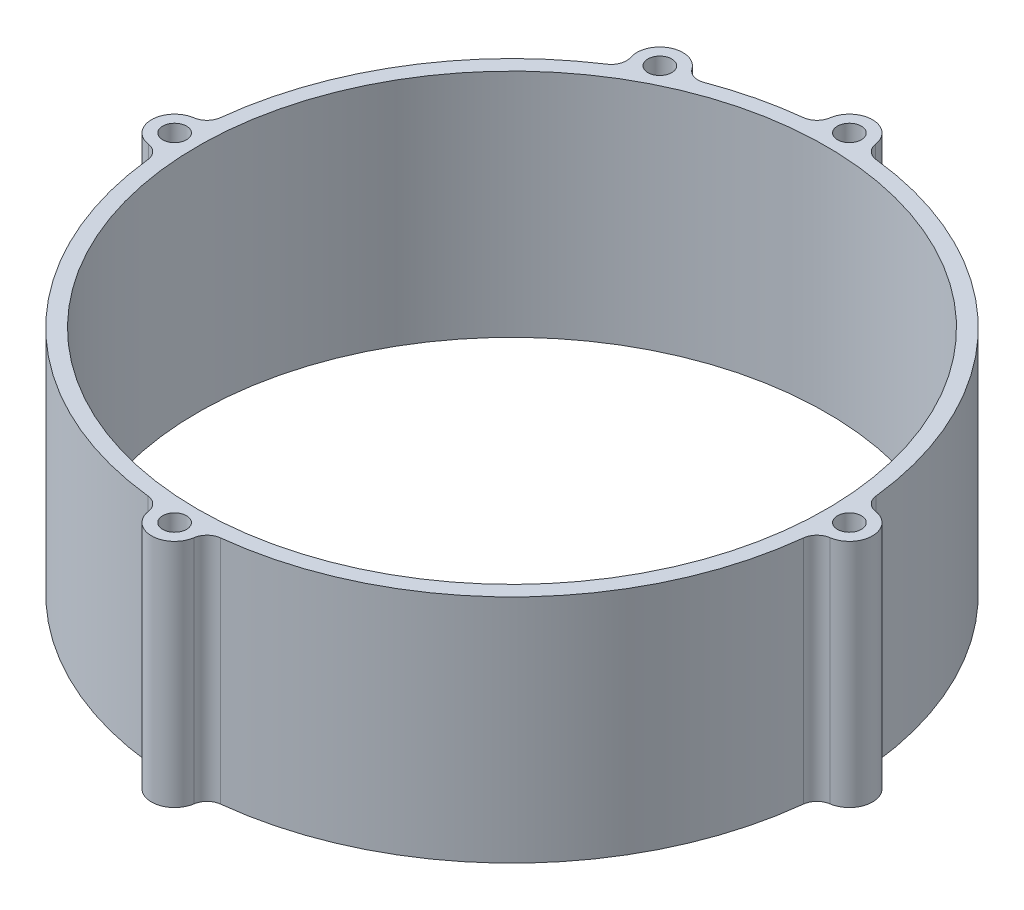
ISO-10303-21;
HEADER;
FILE_DESCRIPTION(('STEP AP214'),'2;1');
FILE_NAME('part.step','',(''),(''),'','','');
FILE_SCHEMA(('AUTOMOTIVE_DESIGN { 1 0 10303 214 1 1 1 1 }'));
ENDSEC;
DATA;
#1=APPLICATION_CONTEXT('core data for automotive mechanical design processes');
#2=APPLICATION_PROTOCOL_DEFINITION('international standard','automotive_design',2000,#1);
#3=PRODUCT_CONTEXT('',#1,'mechanical');
#4=PRODUCT('Part','Part','',(#3));
#5=PRODUCT_RELATED_PRODUCT_CATEGORY('part','',(#4));
#6=PRODUCT_DEFINITION_FORMATION('','',#4);
#7=PRODUCT_DEFINITION_CONTEXT('part definition',#1,'design');
#8=PRODUCT_DEFINITION('design','',#6,#7);
#9=PRODUCT_DEFINITION_SHAPE('','',#8);
#10=(LENGTH_UNIT() NAMED_UNIT(*) SI_UNIT(.MILLI.,.METRE.));
#11=(NAMED_UNIT(*) PLANE_ANGLE_UNIT() SI_UNIT($,.RADIAN.));
#12=(NAMED_UNIT(*) SI_UNIT($,.STERADIAN.) SOLID_ANGLE_UNIT());
#13=UNCERTAINTY_MEASURE_WITH_UNIT(LENGTH_MEASURE(1.E-05),#10,'distance_accuracy_value','');
#14=(GEOMETRIC_REPRESENTATION_CONTEXT(3) GLOBAL_UNCERTAINTY_ASSIGNED_CONTEXT((#13)) GLOBAL_UNIT_ASSIGNED_CONTEXT((#10,
#11,#12)) REPRESENTATION_CONTEXT('',''));
#15=CARTESIAN_POINT('',(0.,0.,0.));
#16=DIRECTION('',(0.,0.,1.));
#17=DIRECTION('',(1.,0.,0.));
#18=AXIS2_PLACEMENT_3D('',#15,#16,#17);
#19=CARTESIAN_POINT('',(-7.90996375997345,30.,-21.0103539550362));
#20=DIRECTION('',(0.,1.,0.));
#21=DIRECTION('',(0.,0.,1.));
#22=AXIS2_PLACEMENT_3D('',#19,#20,#21);
#23=PLANE('',#22);
#24=CARTESIAN_POINT('',(-43.9,30.,0.));
#25=DIRECTION('',(0.,1.,0.));
#26=DIRECTION('',(0.,0.,1.));
#27=AXIS2_PLACEMENT_3D('',#24,#25,#26);
#28=CIRCLE('',#27,1.55);
#29=CARTESIAN_POINT('',(-43.9,30.,1.55));
#30=VERTEX_POINT('',#29);
#31=EDGE_CURVE('E409',#30,#30,#28,.T.);
#32=ORIENTED_EDGE('',*,*,#31,.F.);
#33=EDGE_LOOP('',(#32));
#34=FACE_BOUND('',#33,.T.);
#35=CARTESIAN_POINT('',(43.9,30.,0.));
#36=DIRECTION('',(0.,1.,0.));
#37=DIRECTION('',(0.,0.,1.));
#38=AXIS2_PLACEMENT_3D('',#35,#36,#37);
#39=CIRCLE('',#38,1.55);
#40=CARTESIAN_POINT('',(43.9,30.,1.55000000000002));
#41=VERTEX_POINT('',#40);
#42=EDGE_CURVE('E421',#41,#41,#39,.T.);
#43=ORIENTED_EDGE('',*,*,#42,.F.);
#44=EDGE_LOOP('',(#43));
#45=FACE_BOUND('',#44,.T.);
#46=CARTESIAN_POINT('',(0.,30.,-43.9));
#47=DIRECTION('',(0.,1.,0.));
#48=DIRECTION('',(0.,0.,1.));
#49=AXIS2_PLACEMENT_3D('',#46,#47,#48);
#50=CIRCLE('',#49,1.55);
#51=CARTESIAN_POINT('',(0.,30.,-42.35));
#52=VERTEX_POINT('',#51);
#53=EDGE_CURVE('E212',#52,#52,#50,.T.);
#54=ORIENTED_EDGE('',*,*,#53,.F.);
#55=EDGE_LOOP('',(#54));
#56=FACE_BOUND('',#55,.T.);
#57=CARTESIAN_POINT('',(-15.8199275199469,30.,-42.0207079100725));
#58=DIRECTION('',(0.,-1.,0.));
#59=DIRECTION('',(0.,0.,1.));
#60=AXIS2_PLACEMENT_3D('',#57,#58,#59);
#61=CIRCLE('',#60,2.);
#62=CARTESIAN_POINT('',(-15.1152536883234,30.,-40.1489614552808));
#63=VERTEX_POINT('',#62);
#64=CARTESIAN_POINT('',(-17.4519565119681,30.,-40.8646450358299));
#65=VERTEX_POINT('',#64);
#66=EDGE_CURVE('E247',#63,#65,#61,.T.);
#67=ORIENTED_EDGE('',*,*,#66,.T.);
#68=CARTESIAN_POINT('',(-19.9,30.,-39.1305507244659));
#69=DIRECTION('',(0.,1.,0.));
#70=DIRECTION('',(0.,0.,1.));
#71=AXIS2_PLACEMENT_3D('',#68,#69,#70);
#72=CIRCLE('',#71,2.99999999999999);
#73=CARTESIAN_POINT('',(-22.743315409618,30.,-38.1737030451413));
#74=VERTEX_POINT('',#73);
#75=EDGE_CURVE('E135',#65,#74,#72,.T.);
#76=ORIENTED_EDGE('',*,*,#75,.T.);
#77=CARTESIAN_POINT('',(-24.63885901603,30.,-37.5358045922583));
#78=DIRECTION('',(0.,-1.,0.));
#79=DIRECTION('',(0.,0.,-1.));
#80=AXIS2_PLACEMENT_3D('',#77,#78,#79);
#81=CIRCLE('',#80,2.);
#82=CARTESIAN_POINT('',(-23.5413597280108,30.,-35.8638311137613));
#83=VERTEX_POINT('',#82);
#84=EDGE_CURVE('E298',#74,#83,#81,.T.);
#85=ORIENTED_EDGE('',*,*,#84,.T.);
#86=CARTESIAN_POINT('',(0.,30.,0.));
#87=DIRECTION('',(0.,1.,0.));
#88=DIRECTION('',(0.,0.,1.));
#89=AXIS2_PLACEMENT_3D('',#86,#87,#88);
#90=CIRCLE('',#89,42.9);
#91=CARTESIAN_POINT('',(-42.638827361233,30.,-4.72656336665109));
#92=VERTEX_POINT('',#91);
#93=EDGE_CURVE('E317',#83,#92,#90,.T.);
#94=ORIENTED_EDGE('',*,*,#93,.T.);
#95=CARTESIAN_POINT('',(-44.6266514806378,30.,-4.94691597115697));
#96=DIRECTION('',(0.,-1.,0.));
#97=DIRECTION('',(0.,0.,1.));
#98=AXIS2_PLACEMENT_3D('',#95,#96,#97);
#99=CIRCLE('',#98,2.);
#100=CARTESIAN_POINT('',(-44.3359908883827,30.,-2.96814958269422));
#101=VERTEX_POINT('',#100);
#102=EDGE_CURVE('E314',#92,#101,#99,.T.);
#103=ORIENTED_EDGE('',*,*,#102,.T.);
#104=CARTESIAN_POINT('',(-43.9,30.,0.));
#105=DIRECTION('',(0.,1.,0.));
#106=DIRECTION('',(0.,0.,1.));
#107=AXIS2_PLACEMENT_3D('',#104,#105,#106);
#108=CIRCLE('',#107,3.00000000000005);
#109=CARTESIAN_POINT('',(-44.3359908883827,30.,2.96814958269417));
#110=VERTEX_POINT('',#109);
#111=EDGE_CURVE('E316',#101,#110,#108,.T.);
#112=ORIENTED_EDGE('',*,*,#111,.T.);
#113=CARTESIAN_POINT('',(-44.6266514806378,30.,4.94691597115686));
#114=DIRECTION('',(0.,-1.,0.));
#115=DIRECTION('',(0.,0.,-1.));
#116=AXIS2_PLACEMENT_3D('',#113,#114,#115);
#117=CIRCLE('',#116,2.);
#118=CARTESIAN_POINT('',(-42.638827361233,30.,4.72656336665099));
#119=VERTEX_POINT('',#118);
#120=EDGE_CURVE('E319',#110,#119,#117,.T.);
#121=ORIENTED_EDGE('',*,*,#120,.T.);
#122=CARTESIAN_POINT('',(0.,30.,0.));
#123=DIRECTION('',(0.,1.,0.));
#124=DIRECTION('',(0.,0.,1.));
#125=AXIS2_PLACEMENT_3D('',#122,#123,#124);
#126=CIRCLE('',#125,42.9);
#127=CARTESIAN_POINT('',(-4.72656336665098,30.,42.638827361233));
#128=VERTEX_POINT('',#127);
#129=EDGE_CURVE('E325',#119,#128,#126,.T.);
#130=ORIENTED_EDGE('',*,*,#129,.T.);
#131=CARTESIAN_POINT('',(-4.94691597115685,30.,44.6266514806378));
#132=DIRECTION('',(0.,-1.,0.));
#133=DIRECTION('',(0.,0.,1.));
#134=AXIS2_PLACEMENT_3D('',#131,#132,#133);
#135=CIRCLE('',#134,2.);
#136=CARTESIAN_POINT('',(-2.9681495826941,30.,44.3359908883827));
#137=VERTEX_POINT('',#136);
#138=EDGE_CURVE('E327',#128,#137,#135,.T.);
#139=ORIENTED_EDGE('',*,*,#138,.T.);
#140=CARTESIAN_POINT('',(0.,30.,43.9));
#141=DIRECTION('',(0.,1.,0.));
#142=DIRECTION('',(0.,0.,1.));
#143=AXIS2_PLACEMENT_3D('',#140,#141,#142);
#144=CIRCLE('',#143,3.);
#145=CARTESIAN_POINT('',(2.96814958269413,30.,44.3359908883827));
#146=VERTEX_POINT('',#145);
#147=EDGE_CURVE('E329',#137,#146,#144,.T.);
#148=ORIENTED_EDGE('',*,*,#147,.T.);
#149=CARTESIAN_POINT('',(4.94691597115688,30.,44.6266514806378));
#150=DIRECTION('',(0.,-1.,0.));
#151=DIRECTION('',(0.,0.,-1.));
#152=AXIS2_PLACEMENT_3D('',#149,#150,#151);
#153=CIRCLE('',#152,2.00000000000001);
#154=CARTESIAN_POINT('',(4.72656336665101,30.,42.638827361233));
#155=VERTEX_POINT('',#154);
#156=EDGE_CURVE('E331',#146,#155,#153,.T.);
#157=ORIENTED_EDGE('',*,*,#156,.T.);
#158=CARTESIAN_POINT('',(0.,30.,0.));
#159=DIRECTION('',(0.,1.,0.));
#160=DIRECTION('',(0.,0.,1.));
#161=AXIS2_PLACEMENT_3D('',#158,#159,#160);
#162=CIRCLE('',#161,42.9);
#163=CARTESIAN_POINT('',(42.638827361233,30.,4.72656336665101));
#164=VERTEX_POINT('',#163);
#165=EDGE_CURVE('E333',#155,#164,#162,.T.);
#166=ORIENTED_EDGE('',*,*,#165,.T.);
#167=CARTESIAN_POINT('',(44.6266514806378,30.,4.94691597115688));
#168=DIRECTION('',(0.,-1.,0.));
#169=DIRECTION('',(0.,0.,1.));
#170=AXIS2_PLACEMENT_3D('',#167,#168,#169);
#171=CIRCLE('',#170,2.);
#172=CARTESIAN_POINT('',(44.3359908883827,30.,2.96814958269413));
#173=VERTEX_POINT('',#172);
#174=EDGE_CURVE('E335',#164,#173,#171,.T.);
#175=ORIENTED_EDGE('',*,*,#174,.T.);
#176=CARTESIAN_POINT('',(43.9,30.,0.));
#177=DIRECTION('',(0.,1.,0.));
#178=DIRECTION('',(0.,0.,1.));
#179=AXIS2_PLACEMENT_3D('',#176,#177,#178);
#180=CIRCLE('',#179,3.);
#181=CARTESIAN_POINT('',(44.3359908883827,30.,-2.9681495826941));
#182=VERTEX_POINT('',#181);
#183=EDGE_CURVE('E337',#173,#182,#180,.T.);
#184=ORIENTED_EDGE('',*,*,#183,.T.);
#185=CARTESIAN_POINT('',(44.6266514806378,30.,-4.94691597115684));
#186=DIRECTION('',(0.,-1.,0.));
#187=DIRECTION('',(0.,0.,-1.));
#188=AXIS2_PLACEMENT_3D('',#185,#186,#187);
#189=CIRCLE('',#188,2.);
#190=CARTESIAN_POINT('',(42.638827361233,30.,-4.72656336665097));
#191=VERTEX_POINT('',#190);
#192=EDGE_CURVE('E339',#182,#191,#189,.T.);
#193=ORIENTED_EDGE('',*,*,#192,.T.);
#194=CARTESIAN_POINT('',(0.,30.,0.));
#195=DIRECTION('',(0.,1.,0.));
#196=DIRECTION('',(0.,0.,1.));
#197=AXIS2_PLACEMENT_3D('',#194,#195,#196);
#198=CIRCLE('',#197,42.9);
#199=CARTESIAN_POINT('',(4.72656336665099,30.,-42.638827361233));
#200=VERTEX_POINT('',#199);
#201=EDGE_CURVE('E341',#191,#200,#198,.T.);
#202=ORIENTED_EDGE('',*,*,#201,.T.);
#203=CARTESIAN_POINT('',(4.94691597115686,30.,-44.6266514806378));
#204=DIRECTION('',(0.,-1.,0.));
#205=DIRECTION('',(0.,0.,1.));
#206=AXIS2_PLACEMENT_3D('',#203,#204,#205);
#207=CIRCLE('',#206,2.);
#208=CARTESIAN_POINT('',(2.96814958269411,30.,-44.3359908883827));
#209=VERTEX_POINT('',#208);
#210=EDGE_CURVE('E190',#200,#209,#207,.T.);
#211=ORIENTED_EDGE('',*,*,#210,.T.);
#212=CARTESIAN_POINT('',(0.,30.,-43.9));
#213=DIRECTION('',(0.,1.,0.));
#214=DIRECTION('',(0.,0.,1.));
#215=AXIS2_PLACEMENT_3D('',#212,#213,#214);
#216=CIRCLE('',#215,3.);
#217=CARTESIAN_POINT('',(-2.96814958269412,30.,-44.3359908883827));
#218=VERTEX_POINT('',#217);
#219=EDGE_CURVE('E184',#209,#218,#216,.T.);
#220=ORIENTED_EDGE('',*,*,#219,.T.);
#221=CARTESIAN_POINT('',(-4.94691597115686,30.,-44.6266514806378));
#222=DIRECTION('',(0.,-1.,0.));
#223=DIRECTION('',(0.,0.,1.));
#224=AXIS2_PLACEMENT_3D('',#221,#222,#223);
#225=CIRCLE('',#224,2.);
#226=CARTESIAN_POINT('',(-4.72656336665099,30.,-42.638827361233));
#227=VERTEX_POINT('',#226);
#228=EDGE_CURVE('E188',#218,#227,#225,.T.);
#229=ORIENTED_EDGE('',*,*,#228,.T.);
#230=CARTESIAN_POINT('',(0.,30.,0.));
#231=DIRECTION('',(0.,1.,0.));
#232=DIRECTION('',(0.,0.,1.));
#233=AXIS2_PLACEMENT_3D('',#230,#231,#232);
#234=CIRCLE('',#233,42.9);
#235=EDGE_CURVE('E56',#227,#63,#234,.T.);
#236=ORIENTED_EDGE('',*,*,#235,.T.);
#237=EDGE_LOOP('',(#67,#76,#85,#94,#103,#112,#121,#130,#139,#148,#157,#166,#175,#184,#193,#202,
#211,#220,#229,#236));
#238=FACE_BOUND('',#237,.T.);
#239=CARTESIAN_POINT('',(-19.9,30.,-39.1305507244659));
#240=DIRECTION('',(0.,1.,0.));
#241=DIRECTION('',(0.,0.,1.));
#242=AXIS2_PLACEMENT_3D('',#239,#240,#241);
#243=CIRCLE('',#242,1.55);
#244=CARTESIAN_POINT('',(-19.9,30.,-37.5805507244659));
#245=VERTEX_POINT('',#244);
#246=EDGE_CURVE('E427',#245,#245,#243,.T.);
#247=ORIENTED_EDGE('',*,*,#246,.F.);
#248=EDGE_LOOP('',(#247));
#249=FACE_BOUND('',#248,.T.);
#250=CARTESIAN_POINT('',(0.,30.,43.9));
#251=DIRECTION('',(0.,1.,0.));
#252=DIRECTION('',(0.,0.,1.));
#253=AXIS2_PLACEMENT_3D('',#250,#251,#252);
#254=CIRCLE('',#253,1.55);
#255=CARTESIAN_POINT('',(0.,30.,45.45));
#256=VERTEX_POINT('',#255);
#257=EDGE_CURVE('E415',#256,#256,#254,.T.);
#258=ORIENTED_EDGE('',*,*,#257,.F.);
#259=EDGE_LOOP('',(#258));
#260=FACE_BOUND('',#259,.T.);
#261=CARTESIAN_POINT('',(0.,30.,0.));
#262=DIRECTION('',(0.,1.,0.));
#263=DIRECTION('',(0.,0.,1.));
#264=AXIS2_PLACEMENT_3D('',#261,#262,#263);
#265=CIRCLE('',#264,40.9);
#266=CARTESIAN_POINT('',(0.,30.,40.9));
#267=VERTEX_POINT('',#266);
#268=EDGE_CURVE('E400',#267,#267,#265,.T.);
#269=ORIENTED_EDGE('',*,*,#268,.F.);
#270=EDGE_LOOP('',(#269));
#271=FACE_BOUND('',#270,.T.);
#272=ADVANCED_FACE('F39',(#34,#45,#56,#238,#249,#260,#271),#23,.T.);
#273=CARTESIAN_POINT('',(-7.90996375997345,0.,-21.0103539550362));
#274=DIRECTION('',(0.,1.,0.));
#275=DIRECTION('',(0.,0.,1.));
#276=AXIS2_PLACEMENT_3D('',#273,#274,#275);
#277=PLANE('',#276);
#278=CARTESIAN_POINT('',(-15.8199275199469,0.,-42.0207079100725));
#279=DIRECTION('',(0.,-1.,0.));
#280=DIRECTION('',(0.,0.,1.));
#281=AXIS2_PLACEMENT_3D('',#278,#279,#280);
#282=CIRCLE('',#281,2.);
#283=CARTESIAN_POINT('',(-15.1152536883234,0.,-40.1489614552808));
#284=VERTEX_POINT('',#283);
#285=CARTESIAN_POINT('',(-17.4519565119681,0.,-40.8646450358299));
#286=VERTEX_POINT('',#285);
#287=EDGE_CURVE('E208',#284,#286,#282,.T.);
#288=ORIENTED_EDGE('',*,*,#287,.F.);
#289=CARTESIAN_POINT('',(0.,0.,0.));
#290=DIRECTION('',(0.,1.,0.));
#291=DIRECTION('',(0.,0.,1.));
#292=AXIS2_PLACEMENT_3D('',#289,#290,#291);
#293=CIRCLE('',#292,42.9);
#294=CARTESIAN_POINT('',(-4.72656336665099,0.,-42.638827361233));
#295=VERTEX_POINT('',#294);
#296=EDGE_CURVE('E127',#295,#284,#293,.T.);
#297=ORIENTED_EDGE('',*,*,#296,.F.);
#298=CARTESIAN_POINT('',(-4.94691597115686,0.,-44.6266514806378));
#299=DIRECTION('',(0.,-1.,0.));
#300=DIRECTION('',(0.,0.,1.));
#301=AXIS2_PLACEMENT_3D('',#298,#299,#300);
#302=CIRCLE('',#301,2.);
#303=CARTESIAN_POINT('',(-2.96814958269412,0.,-44.3359908883827));
#304=VERTEX_POINT('',#303);
#305=EDGE_CURVE('E121',#304,#295,#302,.T.);
#306=ORIENTED_EDGE('',*,*,#305,.F.);
#307=CARTESIAN_POINT('',(0.,0.,-43.9));
#308=DIRECTION('',(0.,1.,0.));
#309=DIRECTION('',(0.,0.,1.));
#310=AXIS2_PLACEMENT_3D('',#307,#308,#309);
#311=CIRCLE('',#310,3.);
#312=CARTESIAN_POINT('',(2.96814958269411,0.,-44.3359908883827));
#313=VERTEX_POINT('',#312);
#314=EDGE_CURVE('E198',#313,#304,#311,.T.);
#315=ORIENTED_EDGE('',*,*,#314,.F.);
#316=CARTESIAN_POINT('',(4.94691597115686,0.,-44.6266514806378));
#317=DIRECTION('',(0.,-1.,0.));
#318=DIRECTION('',(0.,0.,1.));
#319=AXIS2_PLACEMENT_3D('',#316,#317,#318);
#320=CIRCLE('',#319,2.);
#321=CARTESIAN_POINT('',(4.72656336665099,0.,-42.638827361233));
#322=VERTEX_POINT('',#321);
#323=EDGE_CURVE('E242',#322,#313,#320,.T.);
#324=ORIENTED_EDGE('',*,*,#323,.F.);
#325=CARTESIAN_POINT('',(0.,0.,0.));
#326=DIRECTION('',(0.,1.,0.));
#327=DIRECTION('',(0.,0.,1.));
#328=AXIS2_PLACEMENT_3D('',#325,#326,#327);
#329=CIRCLE('',#328,42.9);
#330=CARTESIAN_POINT('',(42.638827361233,0.,-4.72656336665097));
#331=VERTEX_POINT('',#330);
#332=EDGE_CURVE('E240',#331,#322,#329,.T.);
#333=ORIENTED_EDGE('',*,*,#332,.F.);
#334=CARTESIAN_POINT('',(44.6266514806378,0.,-4.94691597115684));
#335=DIRECTION('',(0.,-1.,0.));
#336=DIRECTION('',(0.,0.,-1.));
#337=AXIS2_PLACEMENT_3D('',#334,#335,#336);
#338=CIRCLE('',#337,2.);
#339=CARTESIAN_POINT('',(44.3359908883827,0.,-2.9681495826941));
#340=VERTEX_POINT('',#339);
#341=EDGE_CURVE('E238',#340,#331,#338,.T.);
#342=ORIENTED_EDGE('',*,*,#341,.F.);
#343=CARTESIAN_POINT('',(43.9,0.,0.));
#344=DIRECTION('',(0.,1.,0.));
#345=DIRECTION('',(0.,0.,1.));
#346=AXIS2_PLACEMENT_3D('',#343,#344,#345);
#347=CIRCLE('',#346,3.);
#348=CARTESIAN_POINT('',(44.3359908883827,0.,2.96814958269413));
#349=VERTEX_POINT('',#348);
#350=EDGE_CURVE('E236',#349,#340,#347,.T.);
#351=ORIENTED_EDGE('',*,*,#350,.F.);
#352=CARTESIAN_POINT('',(44.6266514806378,0.,4.94691597115688));
#353=DIRECTION('',(0.,-1.,0.));
#354=DIRECTION('',(0.,0.,1.));
#355=AXIS2_PLACEMENT_3D('',#352,#353,#354);
#356=CIRCLE('',#355,2.);
#357=CARTESIAN_POINT('',(42.638827361233,0.,4.72656336665101));
#358=VERTEX_POINT('',#357);
#359=EDGE_CURVE('E234',#358,#349,#356,.T.);
#360=ORIENTED_EDGE('',*,*,#359,.F.);
#361=CARTESIAN_POINT('',(0.,0.,0.));
#362=DIRECTION('',(0.,1.,0.));
#363=DIRECTION('',(0.,0.,1.));
#364=AXIS2_PLACEMENT_3D('',#361,#362,#363);
#365=CIRCLE('',#364,42.9);
#366=CARTESIAN_POINT('',(4.72656336665101,0.,42.638827361233));
#367=VERTEX_POINT('',#366);
#368=EDGE_CURVE('E232',#367,#358,#365,.T.);
#369=ORIENTED_EDGE('',*,*,#368,.F.);
#370=CARTESIAN_POINT('',(4.94691597115688,0.,44.6266514806378));
#371=DIRECTION('',(0.,-1.,0.));
#372=DIRECTION('',(0.,0.,-1.));
#373=AXIS2_PLACEMENT_3D('',#370,#371,#372);
#374=CIRCLE('',#373,2.00000000000001);
#375=CARTESIAN_POINT('',(2.96814958269413,0.,44.3359908883827));
#376=VERTEX_POINT('',#375);
#377=EDGE_CURVE('E230',#376,#367,#374,.T.);
#378=ORIENTED_EDGE('',*,*,#377,.F.);
#379=CARTESIAN_POINT('',(0.,0.,43.9));
#380=DIRECTION('',(0.,1.,0.));
#381=DIRECTION('',(0.,0.,1.));
#382=AXIS2_PLACEMENT_3D('',#379,#380,#381);
#383=CIRCLE('',#382,3.);
#384=CARTESIAN_POINT('',(-2.9681495826941,0.,44.3359908883827));
#385=VERTEX_POINT('',#384);
#386=EDGE_CURVE('E228',#385,#376,#383,.T.);
#387=ORIENTED_EDGE('',*,*,#386,.F.);
#388=CARTESIAN_POINT('',(-4.94691597115685,0.,44.6266514806378));
#389=DIRECTION('',(0.,-1.,0.));
#390=DIRECTION('',(0.,0.,1.));
#391=AXIS2_PLACEMENT_3D('',#388,#389,#390);
#392=CIRCLE('',#391,2.);
#393=CARTESIAN_POINT('',(-4.72656336665098,0.,42.638827361233));
#394=VERTEX_POINT('',#393);
#395=EDGE_CURVE('E226',#394,#385,#392,.T.);
#396=ORIENTED_EDGE('',*,*,#395,.F.);
#397=CARTESIAN_POINT('',(0.,0.,0.));
#398=DIRECTION('',(0.,1.,0.));
#399=DIRECTION('',(0.,0.,1.));
#400=AXIS2_PLACEMENT_3D('',#397,#398,#399);
#401=CIRCLE('',#400,42.9);
#402=CARTESIAN_POINT('',(-42.638827361233,0.,4.72656336665099));
#403=VERTEX_POINT('',#402);
#404=EDGE_CURVE('E224',#403,#394,#401,.T.);
#405=ORIENTED_EDGE('',*,*,#404,.F.);
#406=CARTESIAN_POINT('',(-44.6266514806378,0.,4.94691597115686));
#407=DIRECTION('',(0.,-1.,0.));
#408=DIRECTION('',(0.,0.,-1.));
#409=AXIS2_PLACEMENT_3D('',#406,#407,#408);
#410=CIRCLE('',#409,2.);
#411=CARTESIAN_POINT('',(-44.3359908883827,0.,2.96814958269417));
#412=VERTEX_POINT('',#411);
#413=EDGE_CURVE('E222',#412,#403,#410,.T.);
#414=ORIENTED_EDGE('',*,*,#413,.F.);
#415=CARTESIAN_POINT('',(-43.9,0.,0.));
#416=DIRECTION('',(0.,1.,0.));
#417=DIRECTION('',(0.,0.,1.));
#418=AXIS2_PLACEMENT_3D('',#415,#416,#417);
#419=CIRCLE('',#418,3.00000000000005);
#420=CARTESIAN_POINT('',(-44.3359908883827,0.,-2.96814958269422));
#421=VERTEX_POINT('',#420);
#422=EDGE_CURVE('E220',#421,#412,#419,.T.);
#423=ORIENTED_EDGE('',*,*,#422,.F.);
#424=CARTESIAN_POINT('',(-44.6266514806378,0.,-4.94691597115697));
#425=DIRECTION('',(0.,-1.,0.));
#426=DIRECTION('',(0.,0.,1.));
#427=AXIS2_PLACEMENT_3D('',#424,#425,#426);
#428=CIRCLE('',#427,2.);
#429=CARTESIAN_POINT('',(-42.638827361233,0.,-4.72656336665109));
#430=VERTEX_POINT('',#429);
#431=EDGE_CURVE('E218',#430,#421,#428,.T.);
#432=ORIENTED_EDGE('',*,*,#431,.F.);
#433=CARTESIAN_POINT('',(0.,0.,0.));
#434=DIRECTION('',(0.,1.,0.));
#435=DIRECTION('',(0.,0.,1.));
#436=AXIS2_PLACEMENT_3D('',#433,#434,#435);
#437=CIRCLE('',#436,42.9);
#438=CARTESIAN_POINT('',(-23.5413597280108,0.,-35.8638311137613));
#439=VERTEX_POINT('',#438);
#440=EDGE_CURVE('E216',#439,#430,#437,.T.);
#441=ORIENTED_EDGE('',*,*,#440,.F.);
#442=CARTESIAN_POINT('',(-24.63885901603,0.,-37.5358045922583));
#443=DIRECTION('',(0.,-1.,0.));
#444=DIRECTION('',(0.,0.,-1.));
#445=AXIS2_PLACEMENT_3D('',#442,#443,#444);
#446=CIRCLE('',#445,2.);
#447=CARTESIAN_POINT('',(-22.743315409618,0.,-38.1737030451413));
#448=VERTEX_POINT('',#447);
#449=EDGE_CURVE('E214',#448,#439,#446,.T.);
#450=ORIENTED_EDGE('',*,*,#449,.F.);
#451=CARTESIAN_POINT('',(-19.9,0.,-39.1305507244659));
#452=DIRECTION('',(0.,1.,0.));
#453=DIRECTION('',(0.,0.,1.));
#454=AXIS2_PLACEMENT_3D('',#451,#452,#453);
#455=CIRCLE('',#454,2.99999999999999);
#456=EDGE_CURVE('E211',#286,#448,#455,.T.);
#457=ORIENTED_EDGE('',*,*,#456,.F.);
#458=EDGE_LOOP('',(#288,#297,#306,#315,#324,#333,#342,#351,#360,#369,#378,#387,#396,#405,#414,
#423,#432,#441,#450,#457));
#459=FACE_BOUND('',#458,.T.);
#460=CARTESIAN_POINT('',(0.,0.,-43.9));
#461=DIRECTION('',(0.,1.,0.));
#462=DIRECTION('',(0.,0.,1.));
#463=AXIS2_PLACEMENT_3D('',#460,#461,#462);
#464=CIRCLE('',#463,1.55);
#465=CARTESIAN_POINT('',(0.,0.,-42.35));
#466=VERTEX_POINT('',#465);
#467=EDGE_CURVE('E430',#466,#466,#464,.T.);
#468=ORIENTED_EDGE('',*,*,#467,.T.);
#469=EDGE_LOOP('',(#468));
#470=FACE_BOUND('',#469,.T.);
#471=CARTESIAN_POINT('',(-19.9,0.,-39.1305507244659));
#472=DIRECTION('',(0.,1.,0.));
#473=DIRECTION('',(0.,0.,1.));
#474=AXIS2_PLACEMENT_3D('',#471,#472,#473);
#475=CIRCLE('',#474,1.55);
#476=CARTESIAN_POINT('',(-19.9,0.,-37.5805507244659));
#477=VERTEX_POINT('',#476);
#478=EDGE_CURVE('E424',#477,#477,#475,.T.);
#479=ORIENTED_EDGE('',*,*,#478,.T.);
#480=EDGE_LOOP('',(#479));
#481=FACE_BOUND('',#480,.T.);
#482=CARTESIAN_POINT('',(43.9,0.,0.));
#483=DIRECTION('',(0.,1.,0.));
#484=DIRECTION('',(0.,0.,1.));
#485=AXIS2_PLACEMENT_3D('',#482,#483,#484);
#486=CIRCLE('',#485,1.55);
#487=CARTESIAN_POINT('',(43.9,0.,1.55000000000002));
#488=VERTEX_POINT('',#487);
#489=EDGE_CURVE('E418',#488,#488,#486,.T.);
#490=ORIENTED_EDGE('',*,*,#489,.T.);
#491=EDGE_LOOP('',(#490));
#492=FACE_BOUND('',#491,.T.);
#493=CARTESIAN_POINT('',(0.,0.,43.9));
#494=DIRECTION('',(0.,1.,0.));
#495=DIRECTION('',(0.,0.,1.));
#496=AXIS2_PLACEMENT_3D('',#493,#494,#495);
#497=CIRCLE('',#496,1.55);
#498=CARTESIAN_POINT('',(0.,0.,45.45));
#499=VERTEX_POINT('',#498);
#500=EDGE_CURVE('E412',#499,#499,#497,.T.);
#501=ORIENTED_EDGE('',*,*,#500,.T.);
#502=EDGE_LOOP('',(#501));
#503=FACE_BOUND('',#502,.T.);
#504=CARTESIAN_POINT('',(-43.9,0.,0.));
#505=DIRECTION('',(0.,1.,0.));
#506=DIRECTION('',(0.,0.,1.));
#507=AXIS2_PLACEMENT_3D('',#504,#505,#506);
#508=CIRCLE('',#507,1.55);
#509=CARTESIAN_POINT('',(-43.9,0.,1.55));
#510=VERTEX_POINT('',#509);
#511=EDGE_CURVE('E406',#510,#510,#508,.T.);
#512=ORIENTED_EDGE('',*,*,#511,.T.);
#513=EDGE_LOOP('',(#512));
#514=FACE_BOUND('',#513,.T.);
#515=CARTESIAN_POINT('',(0.,0.,0.));
#516=DIRECTION('',(0.,1.,0.));
#517=DIRECTION('',(0.,0.,1.));
#518=AXIS2_PLACEMENT_3D('',#515,#516,#517);
#519=CIRCLE('',#518,40.9);
#520=CARTESIAN_POINT('',(0.,0.,40.9));
#521=VERTEX_POINT('',#520);
#522=EDGE_CURVE('E403',#521,#521,#519,.T.);
#523=ORIENTED_EDGE('',*,*,#522,.T.);
#524=EDGE_LOOP('',(#523));
#525=FACE_BOUND('',#524,.T.);
#526=ADVANCED_FACE('F302',(#459,#470,#481,#492,#503,#514,#525),#277,.F.);
#527=CARTESIAN_POINT('',(-15.8199275199469,30.,-42.0207079100725));
#528=DIRECTION('',(0.,-1.,0.));
#529=DIRECTION('',(0.,0.,-1.));
#530=AXIS2_PLACEMENT_3D('',#527,#528,#529);
#531=CYLINDRICAL_SURFACE('',#530,2.);
#532=ORIENTED_EDGE('',*,*,#287,.T.);
#533=DIRECTION('',(0.,-1.,0.));
#534=VECTOR('',#533,1.);
#535=CARTESIAN_POINT('',(-17.4519565119681,30.,-40.8646450358299));
#536=LINE('',#535,#534);
#537=EDGE_CURVE('E11',#65,#286,#536,.T.);
#538=ORIENTED_EDGE('',*,*,#537,.F.);
#539=ORIENTED_EDGE('',*,*,#66,.F.);
#540=DIRECTION('',(0.,-1.,0.));
#541=VECTOR('',#540,1.);
#542=CARTESIAN_POINT('',(-15.1152536883234,30.,-40.1489614552808));
#543=LINE('',#542,#541);
#544=EDGE_CURVE('E204',#63,#284,#543,.T.);
#545=ORIENTED_EDGE('',*,*,#544,.T.);
#546=EDGE_LOOP('',(#532,#538,#539,#545));
#547=FACE_BOUND('',#546,.T.);
#548=ADVANCED_FACE('F41',(#547),#531,.F.);
#549=CARTESIAN_POINT('',(-19.9,30.,-39.1305507244659));
#550=DIRECTION('',(0.,-1.,0.));
#551=DIRECTION('',(0.,0.,-1.));
#552=AXIS2_PLACEMENT_3D('',#549,#550,#551);
#553=CYLINDRICAL_SURFACE('',#552,2.99999999999999);
#554=ORIENTED_EDGE('',*,*,#456,.T.);
#555=DIRECTION('',(0.,-1.,0.));
#556=VECTOR('',#555,1.);
#557=CARTESIAN_POINT('',(-22.743315409618,30.,-38.1737030451413));
#558=LINE('',#557,#556);
#559=EDGE_CURVE('E48',#74,#448,#558,.T.);
#560=ORIENTED_EDGE('',*,*,#559,.F.);
#561=ORIENTED_EDGE('',*,*,#75,.F.);
#562=ORIENTED_EDGE('',*,*,#537,.T.);
#563=EDGE_LOOP('',(#554,#560,#561,#562));
#564=FACE_BOUND('',#563,.T.);
#565=ADVANCED_FACE('F536',(#564),#553,.T.);
#566=CARTESIAN_POINT('',(-24.63885901603,30.,-37.5358045922583));
#567=DIRECTION('',(0.,-1.,0.));
#568=DIRECTION('',(0.,0.,-1.));
#569=AXIS2_PLACEMENT_3D('',#566,#567,#568);
#570=CYLINDRICAL_SURFACE('',#569,2.);
#571=ORIENTED_EDGE('',*,*,#449,.T.);
#572=DIRECTION('',(0.,-1.,0.));
#573=VECTOR('',#572,1.);
#574=CARTESIAN_POINT('',(-23.5413597280108,30.,-35.8638311137613));
#575=LINE('',#574,#573);
#576=EDGE_CURVE('E290',#83,#439,#575,.T.);
#577=ORIENTED_EDGE('',*,*,#576,.F.);
#578=ORIENTED_EDGE('',*,*,#84,.F.);
#579=ORIENTED_EDGE('',*,*,#559,.T.);
#580=EDGE_LOOP('',(#571,#577,#578,#579));
#581=FACE_BOUND('',#580,.T.);
#582=ADVANCED_FACE('F296',(#581),#570,.F.);
#583=CARTESIAN_POINT('',(0.,30.,0.));
#584=DIRECTION('',(0.,-1.,0.));
#585=DIRECTION('',(0.,0.,-1.));
#586=AXIS2_PLACEMENT_3D('',#583,#584,#585);
#587=CYLINDRICAL_SURFACE('',#586,42.9);
#588=ORIENTED_EDGE('',*,*,#440,.T.);
#589=DIRECTION('',(0.,-1.,0.));
#590=VECTOR('',#589,1.);
#591=CARTESIAN_POINT('',(-42.638827361233,30.,-4.72656336665109));
#592=LINE('',#591,#590);
#593=EDGE_CURVE('E287',#92,#430,#592,.T.);
#594=ORIENTED_EDGE('',*,*,#593,.F.);
#595=ORIENTED_EDGE('',*,*,#93,.F.);
#596=ORIENTED_EDGE('',*,*,#576,.T.);
#597=EDGE_LOOP('',(#588,#594,#595,#596));
#598=FACE_BOUND('',#597,.T.);
#599=ADVANCED_FACE('F308',(#598),#587,.T.);
#600=CARTESIAN_POINT('',(-44.6266514806378,30.,-4.94691597115697));
#601=DIRECTION('',(0.,-1.,0.));
#602=DIRECTION('',(0.,0.,-1.));
#603=AXIS2_PLACEMENT_3D('',#600,#601,#602);
#604=CYLINDRICAL_SURFACE('',#603,2.);
#605=ORIENTED_EDGE('',*,*,#431,.T.);
#606=DIRECTION('',(0.,-1.,0.));
#607=VECTOR('',#606,1.);
#608=CARTESIAN_POINT('',(-44.3359908883827,30.,-2.96814958269422));
#609=LINE('',#608,#607);
#610=EDGE_CURVE('E284',#101,#421,#609,.T.);
#611=ORIENTED_EDGE('',*,*,#610,.F.);
#612=ORIENTED_EDGE('',*,*,#102,.F.);
#613=ORIENTED_EDGE('',*,*,#593,.T.);
#614=EDGE_LOOP('',(#605,#611,#612,#613));
#615=FACE_BOUND('',#614,.T.);
#616=ADVANCED_FACE('F312',(#615),#604,.F.);
#617=CARTESIAN_POINT('',(-43.9,30.,0.));
#618=DIRECTION('',(0.,-1.,0.));
#619=DIRECTION('',(0.,0.,-1.));
#620=AXIS2_PLACEMENT_3D('',#617,#618,#619);
#621=CYLINDRICAL_SURFACE('',#620,3.00000000000005);
#622=ORIENTED_EDGE('',*,*,#422,.T.);
#623=DIRECTION('',(0.,-1.,0.));
#624=VECTOR('',#623,1.);
#625=CARTESIAN_POINT('',(-44.3359908883827,30.,2.96814958269417));
#626=LINE('',#625,#624);
#627=EDGE_CURVE('E281',#110,#412,#626,.T.);
#628=ORIENTED_EDGE('',*,*,#627,.F.);
#629=ORIENTED_EDGE('',*,*,#111,.F.);
#630=ORIENTED_EDGE('',*,*,#610,.T.);
#631=EDGE_LOOP('',(#622,#628,#629,#630));
#632=FACE_BOUND('',#631,.T.);
#633=ADVANCED_FACE('F567',(#632),#621,.T.);
#634=CARTESIAN_POINT('',(-44.6266514806378,30.,4.94691597115686));
#635=DIRECTION('',(0.,-1.,0.));
#636=DIRECTION('',(0.,0.,-1.));
#637=AXIS2_PLACEMENT_3D('',#634,#635,#636);
#638=CYLINDRICAL_SURFACE('',#637,2.);
#639=ORIENTED_EDGE('',*,*,#413,.T.);
#640=DIRECTION('',(0.,-1.,0.));
#641=VECTOR('',#640,1.);
#642=CARTESIAN_POINT('',(-42.638827361233,30.,4.72656336665099));
#643=LINE('',#642,#641);
#644=EDGE_CURVE('E278',#119,#403,#643,.T.);
#645=ORIENTED_EDGE('',*,*,#644,.F.);
#646=ORIENTED_EDGE('',*,*,#120,.F.);
#647=ORIENTED_EDGE('',*,*,#627,.T.);
#648=EDGE_LOOP('',(#639,#645,#646,#647));
#649=FACE_BOUND('',#648,.T.);
#650=ADVANCED_FACE('F576',(#649),#638,.F.);
#651=CARTESIAN_POINT('',(0.,30.,0.));
#652=DIRECTION('',(0.,-1.,0.));
#653=DIRECTION('',(0.,0.,-1.));
#654=AXIS2_PLACEMENT_3D('',#651,#652,#653);
#655=CYLINDRICAL_SURFACE('',#654,42.9);
#656=ORIENTED_EDGE('',*,*,#404,.T.);
#657=DIRECTION('',(0.,-1.,0.));
#658=VECTOR('',#657,1.);
#659=CARTESIAN_POINT('',(-4.72656336665098,30.,42.638827361233));
#660=LINE('',#659,#658);
#661=EDGE_CURVE('E275',#128,#394,#660,.T.);
#662=ORIENTED_EDGE('',*,*,#661,.F.);
#663=ORIENTED_EDGE('',*,*,#129,.F.);
#664=ORIENTED_EDGE('',*,*,#644,.T.);
#665=EDGE_LOOP('',(#656,#662,#663,#664));
#666=FACE_BOUND('',#665,.T.);
#667=ADVANCED_FACE('F586',(#666),#655,.T.);
#668=CARTESIAN_POINT('',(-4.94691597115685,30.,44.6266514806378));
#669=DIRECTION('',(0.,-1.,0.));
#670=DIRECTION('',(0.,0.,-1.));
#671=AXIS2_PLACEMENT_3D('',#668,#669,#670);
#672=CYLINDRICAL_SURFACE('',#671,2.);
#673=ORIENTED_EDGE('',*,*,#395,.T.);
#674=DIRECTION('',(0.,-1.,0.));
#675=VECTOR('',#674,1.);
#676=CARTESIAN_POINT('',(-2.9681495826941,30.,44.3359908883827));
#677=LINE('',#676,#675);
#678=EDGE_CURVE('E272',#137,#385,#677,.T.);
#679=ORIENTED_EDGE('',*,*,#678,.F.);
#680=ORIENTED_EDGE('',*,*,#138,.F.);
#681=ORIENTED_EDGE('',*,*,#661,.T.);
#682=EDGE_LOOP('',(#673,#679,#680,#681));
#683=FACE_BOUND('',#682,.T.);
#684=ADVANCED_FACE('F596',(#683),#672,.F.);
#685=CARTESIAN_POINT('',(0.,30.,43.9));
#686=DIRECTION('',(0.,-1.,0.));
#687=DIRECTION('',(0.,0.,-1.));
#688=AXIS2_PLACEMENT_3D('',#685,#686,#687);
#689=CYLINDRICAL_SURFACE('',#688,3.);
#690=ORIENTED_EDGE('',*,*,#386,.T.);
#691=DIRECTION('',(0.,-1.,0.));
#692=VECTOR('',#691,1.);
#693=CARTESIAN_POINT('',(2.96814958269413,30.,44.3359908883827));
#694=LINE('',#693,#692);
#695=EDGE_CURVE('E269',#146,#376,#694,.T.);
#696=ORIENTED_EDGE('',*,*,#695,.F.);
#697=ORIENTED_EDGE('',*,*,#147,.F.);
#698=ORIENTED_EDGE('',*,*,#678,.T.);
#699=EDGE_LOOP('',(#690,#696,#697,#698));
#700=FACE_BOUND('',#699,.T.);
#701=ADVANCED_FACE('F606',(#700),#689,.T.);
#702=CARTESIAN_POINT('',(4.94691597115688,30.,44.6266514806378));
#703=DIRECTION('',(0.,-1.,0.));
#704=DIRECTION('',(0.,0.,-1.));
#705=AXIS2_PLACEMENT_3D('',#702,#703,#704);
#706=CYLINDRICAL_SURFACE('',#705,2.00000000000001);
#707=ORIENTED_EDGE('',*,*,#377,.T.);
#708=DIRECTION('',(0.,-1.,0.));
#709=VECTOR('',#708,1.);
#710=CARTESIAN_POINT('',(4.72656336665101,30.,42.638827361233));
#711=LINE('',#710,#709);
#712=EDGE_CURVE('E266',#155,#367,#711,.T.);
#713=ORIENTED_EDGE('',*,*,#712,.F.);
#714=ORIENTED_EDGE('',*,*,#156,.F.);
#715=ORIENTED_EDGE('',*,*,#695,.T.);
#716=EDGE_LOOP('',(#707,#713,#714,#715));
#717=FACE_BOUND('',#716,.T.);
#718=ADVANCED_FACE('F616',(#717),#706,.F.);
#719=CARTESIAN_POINT('',(0.,30.,0.));
#720=DIRECTION('',(0.,-1.,0.));
#721=DIRECTION('',(0.,0.,-1.));
#722=AXIS2_PLACEMENT_3D('',#719,#720,#721);
#723=CYLINDRICAL_SURFACE('',#722,42.9);
#724=ORIENTED_EDGE('',*,*,#368,.T.);
#725=DIRECTION('',(0.,-1.,0.));
#726=VECTOR('',#725,1.);
#727=CARTESIAN_POINT('',(42.638827361233,30.,4.72656336665101));
#728=LINE('',#727,#726);
#729=EDGE_CURVE('E263',#164,#358,#728,.T.);
#730=ORIENTED_EDGE('',*,*,#729,.F.);
#731=ORIENTED_EDGE('',*,*,#165,.F.);
#732=ORIENTED_EDGE('',*,*,#712,.T.);
#733=EDGE_LOOP('',(#724,#730,#731,#732));
#734=FACE_BOUND('',#733,.T.);
#735=ADVANCED_FACE('F626',(#734),#723,.T.);
#736=CARTESIAN_POINT('',(44.6266514806378,30.,4.94691597115688));
#737=DIRECTION('',(0.,-1.,0.));
#738=DIRECTION('',(0.,0.,-1.));
#739=AXIS2_PLACEMENT_3D('',#736,#737,#738);
#740=CYLINDRICAL_SURFACE('',#739,2.);
#741=ORIENTED_EDGE('',*,*,#359,.T.);
#742=DIRECTION('',(0.,-1.,0.));
#743=VECTOR('',#742,1.);
#744=CARTESIAN_POINT('',(44.3359908883827,30.,2.96814958269413));
#745=LINE('',#744,#743);
#746=EDGE_CURVE('E260',#173,#349,#745,.T.);
#747=ORIENTED_EDGE('',*,*,#746,.F.);
#748=ORIENTED_EDGE('',*,*,#174,.F.);
#749=ORIENTED_EDGE('',*,*,#729,.T.);
#750=EDGE_LOOP('',(#741,#747,#748,#749));
#751=FACE_BOUND('',#750,.T.);
#752=ADVANCED_FACE('F636',(#751),#740,.F.);
#753=CARTESIAN_POINT('',(43.9,30.,0.));
#754=DIRECTION('',(0.,-1.,0.));
#755=DIRECTION('',(0.,0.,-1.));
#756=AXIS2_PLACEMENT_3D('',#753,#754,#755);
#757=CYLINDRICAL_SURFACE('',#756,3.);
#758=ORIENTED_EDGE('',*,*,#350,.T.);
#759=DIRECTION('',(0.,-1.,0.));
#760=VECTOR('',#759,1.);
#761=CARTESIAN_POINT('',(44.3359908883827,30.,-2.9681495826941));
#762=LINE('',#761,#760);
#763=EDGE_CURVE('E257',#182,#340,#762,.T.);
#764=ORIENTED_EDGE('',*,*,#763,.F.);
#765=ORIENTED_EDGE('',*,*,#183,.F.);
#766=ORIENTED_EDGE('',*,*,#746,.T.);
#767=EDGE_LOOP('',(#758,#764,#765,#766));
#768=FACE_BOUND('',#767,.T.);
#769=ADVANCED_FACE('F646',(#768),#757,.T.);
#770=CARTESIAN_POINT('',(44.6266514806378,30.,-4.94691597115684));
#771=DIRECTION('',(0.,-1.,0.));
#772=DIRECTION('',(0.,0.,-1.));
#773=AXIS2_PLACEMENT_3D('',#770,#771,#772);
#774=CYLINDRICAL_SURFACE('',#773,2.);
#775=ORIENTED_EDGE('',*,*,#341,.T.);
#776=DIRECTION('',(0.,-1.,0.));
#777=VECTOR('',#776,1.);
#778=CARTESIAN_POINT('',(42.638827361233,30.,-4.72656336665097));
#779=LINE('',#778,#777);
#780=EDGE_CURVE('E254',#191,#331,#779,.T.);
#781=ORIENTED_EDGE('',*,*,#780,.F.);
#782=ORIENTED_EDGE('',*,*,#192,.F.);
#783=ORIENTED_EDGE('',*,*,#763,.T.);
#784=EDGE_LOOP('',(#775,#781,#782,#783));
#785=FACE_BOUND('',#784,.T.);
#786=ADVANCED_FACE('F656',(#785),#774,.F.);
#787=CARTESIAN_POINT('',(0.,30.,0.));
#788=DIRECTION('',(0.,-1.,0.));
#789=DIRECTION('',(0.,0.,-1.));
#790=AXIS2_PLACEMENT_3D('',#787,#788,#789);
#791=CYLINDRICAL_SURFACE('',#790,42.9);
#792=ORIENTED_EDGE('',*,*,#332,.T.);
#793=DIRECTION('',(0.,-1.,0.));
#794=VECTOR('',#793,1.);
#795=CARTESIAN_POINT('',(4.72656336665099,30.,-42.638827361233));
#796=LINE('',#795,#794);
#797=EDGE_CURVE('E251',#200,#322,#796,.T.);
#798=ORIENTED_EDGE('',*,*,#797,.F.);
#799=ORIENTED_EDGE('',*,*,#201,.F.);
#800=ORIENTED_EDGE('',*,*,#780,.T.);
#801=EDGE_LOOP('',(#792,#798,#799,#800));
#802=FACE_BOUND('',#801,.T.);
#803=ADVANCED_FACE('F347',(#802),#791,.T.);
#804=CARTESIAN_POINT('',(4.94691597115686,30.,-44.6266514806378));
#805=DIRECTION('',(0.,-1.,0.));
#806=DIRECTION('',(0.,0.,-1.));
#807=AXIS2_PLACEMENT_3D('',#804,#805,#806);
#808=CYLINDRICAL_SURFACE('',#807,2.);
#809=ORIENTED_EDGE('',*,*,#323,.T.);
#810=DIRECTION('',(0.,-1.,0.));
#811=VECTOR('',#810,1.);
#812=CARTESIAN_POINT('',(2.96814958269411,30.,-44.3359908883827));
#813=LINE('',#812,#811);
#814=EDGE_CURVE('E199',#209,#313,#813,.T.);
#815=ORIENTED_EDGE('',*,*,#814,.F.);
#816=ORIENTED_EDGE('',*,*,#210,.F.);
#817=ORIENTED_EDGE('',*,*,#797,.T.);
#818=EDGE_LOOP('',(#809,#815,#816,#817));
#819=FACE_BOUND('',#818,.T.);
#820=ADVANCED_FACE('F351',(#819),#808,.F.);
#821=CARTESIAN_POINT('',(0.,30.,-43.9));
#822=DIRECTION('',(0.,-1.,0.));
#823=DIRECTION('',(0.,0.,-1.));
#824=AXIS2_PLACEMENT_3D('',#821,#822,#823);
#825=CYLINDRICAL_SURFACE('',#824,3.);
#826=ORIENTED_EDGE('',*,*,#314,.T.);
#827=DIRECTION('',(0.,-1.,0.));
#828=VECTOR('',#827,1.);
#829=CARTESIAN_POINT('',(-2.96814958269412,30.,-44.3359908883827));
#830=LINE('',#829,#828);
#831=EDGE_CURVE('E195',#218,#304,#830,.T.);
#832=ORIENTED_EDGE('',*,*,#831,.F.);
#833=ORIENTED_EDGE('',*,*,#219,.F.);
#834=ORIENTED_EDGE('',*,*,#814,.T.);
#835=EDGE_LOOP('',(#826,#832,#833,#834));
#836=FACE_BOUND('',#835,.T.);
#837=ADVANCED_FACE('F196',(#836),#825,.T.);
#838=CARTESIAN_POINT('',(-4.94691597115686,30.,-44.6266514806378));
#839=DIRECTION('',(0.,-1.,0.));
#840=DIRECTION('',(0.,0.,-1.));
#841=AXIS2_PLACEMENT_3D('',#838,#839,#840);
#842=CYLINDRICAL_SURFACE('',#841,2.);
#843=ORIENTED_EDGE('',*,*,#305,.T.);
#844=DIRECTION('',(0.,-1.,0.));
#845=VECTOR('',#844,1.);
#846=CARTESIAN_POINT('',(-4.72656336665099,30.,-42.638827361233));
#847=LINE('',#846,#845);
#848=EDGE_CURVE('E200',#227,#295,#847,.T.);
#849=ORIENTED_EDGE('',*,*,#848,.F.);
#850=ORIENTED_EDGE('',*,*,#228,.F.);
#851=ORIENTED_EDGE('',*,*,#831,.T.);
#852=EDGE_LOOP('',(#843,#849,#850,#851));
#853=FACE_BOUND('',#852,.T.);
#854=ADVANCED_FACE('F202',(#853),#842,.F.);
#855=CARTESIAN_POINT('',(0.,30.,0.));
#856=DIRECTION('',(0.,-1.,0.));
#857=DIRECTION('',(0.,0.,-1.));
#858=AXIS2_PLACEMENT_3D('',#855,#856,#857);
#859=CYLINDRICAL_SURFACE('',#858,42.9);
#860=ORIENTED_EDGE('',*,*,#296,.T.);
#861=ORIENTED_EDGE('',*,*,#544,.F.);
#862=ORIENTED_EDGE('',*,*,#235,.F.);
#863=ORIENTED_EDGE('',*,*,#848,.T.);
#864=EDGE_LOOP('',(#860,#861,#862,#863));
#865=FACE_BOUND('',#864,.T.);
#866=ADVANCED_FACE('F355',(#865),#859,.T.);
#867=CARTESIAN_POINT('',(0.,30.,-43.9));
#868=DIRECTION('',(0.,-1.,0.));
#869=DIRECTION('',(0.,0.,-1.));
#870=AXIS2_PLACEMENT_3D('',#867,#868,#869);
#871=CYLINDRICAL_SURFACE('',#870,1.55);
#872=ORIENTED_EDGE('',*,*,#53,.T.);
#873=EDGE_LOOP('',(#872));
#874=FACE_BOUND('',#873,.T.);
#875=ORIENTED_EDGE('',*,*,#467,.F.);
#876=EDGE_LOOP('',(#875));
#877=FACE_BOUND('',#876,.T.);
#878=ADVANCED_FACE('F357',(#874,#877),#871,.F.);
#879=CARTESIAN_POINT('',(-19.9,30.,-39.1305507244659));
#880=DIRECTION('',(0.,-1.,0.));
#881=DIRECTION('',(0.,0.,-1.));
#882=AXIS2_PLACEMENT_3D('',#879,#880,#881);
#883=CYLINDRICAL_SURFACE('',#882,1.55);
#884=ORIENTED_EDGE('',*,*,#246,.T.);
#885=EDGE_LOOP('',(#884));
#886=FACE_BOUND('',#885,.T.);
#887=ORIENTED_EDGE('',*,*,#478,.F.);
#888=EDGE_LOOP('',(#887));
#889=FACE_BOUND('',#888,.T.);
#890=ADVANCED_FACE('F363',(#886,#889),#883,.F.);
#891=CARTESIAN_POINT('',(43.9,30.,0.));
#892=DIRECTION('',(0.,-1.,0.));
#893=DIRECTION('',(0.,0.,-1.));
#894=AXIS2_PLACEMENT_3D('',#891,#892,#893);
#895=CYLINDRICAL_SURFACE('',#894,1.55);
#896=ORIENTED_EDGE('',*,*,#42,.T.);
#897=EDGE_LOOP('',(#896));
#898=FACE_BOUND('',#897,.T.);
#899=ORIENTED_EDGE('',*,*,#489,.F.);
#900=EDGE_LOOP('',(#899));
#901=FACE_BOUND('',#900,.T.);
#902=ADVANCED_FACE('F379',(#898,#901),#895,.F.);
#903=CARTESIAN_POINT('',(0.,30.,43.9));
#904=DIRECTION('',(0.,-1.,0.));
#905=DIRECTION('',(0.,0.,-1.));
#906=AXIS2_PLACEMENT_3D('',#903,#904,#905);
#907=CYLINDRICAL_SURFACE('',#906,1.55);
#908=ORIENTED_EDGE('',*,*,#257,.T.);
#909=EDGE_LOOP('',(#908));
#910=FACE_BOUND('',#909,.T.);
#911=ORIENTED_EDGE('',*,*,#500,.F.);
#912=EDGE_LOOP('',(#911));
#913=FACE_BOUND('',#912,.T.);
#914=ADVANCED_FACE('F383',(#910,#913),#907,.F.);
#915=CARTESIAN_POINT('',(-43.9,30.,0.));
#916=DIRECTION('',(0.,-1.,0.));
#917=DIRECTION('',(0.,0.,-1.));
#918=AXIS2_PLACEMENT_3D('',#915,#916,#917);
#919=CYLINDRICAL_SURFACE('',#918,1.55);
#920=ORIENTED_EDGE('',*,*,#31,.T.);
#921=EDGE_LOOP('',(#920));
#922=FACE_BOUND('',#921,.T.);
#923=ORIENTED_EDGE('',*,*,#511,.F.);
#924=EDGE_LOOP('',(#923));
#925=FACE_BOUND('',#924,.T.);
#926=ADVANCED_FACE('F387',(#922,#925),#919,.F.);
#927=CARTESIAN_POINT('',(0.,30.,0.));
#928=DIRECTION('',(0.,-1.,0.));
#929=DIRECTION('',(0.,0.,-1.));
#930=AXIS2_PLACEMENT_3D('',#927,#928,#929);
#931=CYLINDRICAL_SURFACE('',#930,40.9);
#932=ORIENTED_EDGE('',*,*,#268,.T.);
#933=EDGE_LOOP('',(#932));
#934=FACE_BOUND('',#933,.T.);
#935=ORIENTED_EDGE('',*,*,#522,.F.);
#936=EDGE_LOOP('',(#935));
#937=FACE_BOUND('',#936,.T.);
#938=ADVANCED_FACE('F391',(#934,#937),#931,.F.);
#939=CLOSED_SHELL('',(#272,#526,#548,#565,#582,#599,#616,#633,#650,#667,#684,#701,#718,#735,
#752,#769,#786,#803,#820,#837,#854,#866,#878,#890,#902,#914,#926,#938));
#940=MANIFOLD_SOLID_BREP('B2',#939);
#941=ADVANCED_BREP_SHAPE_REPRESENTATION('',(#18,#940),#14);
#942=SHAPE_DEFINITION_REPRESENTATION(#9,#941);
ENDSEC;
END-ISO-10303-21;
